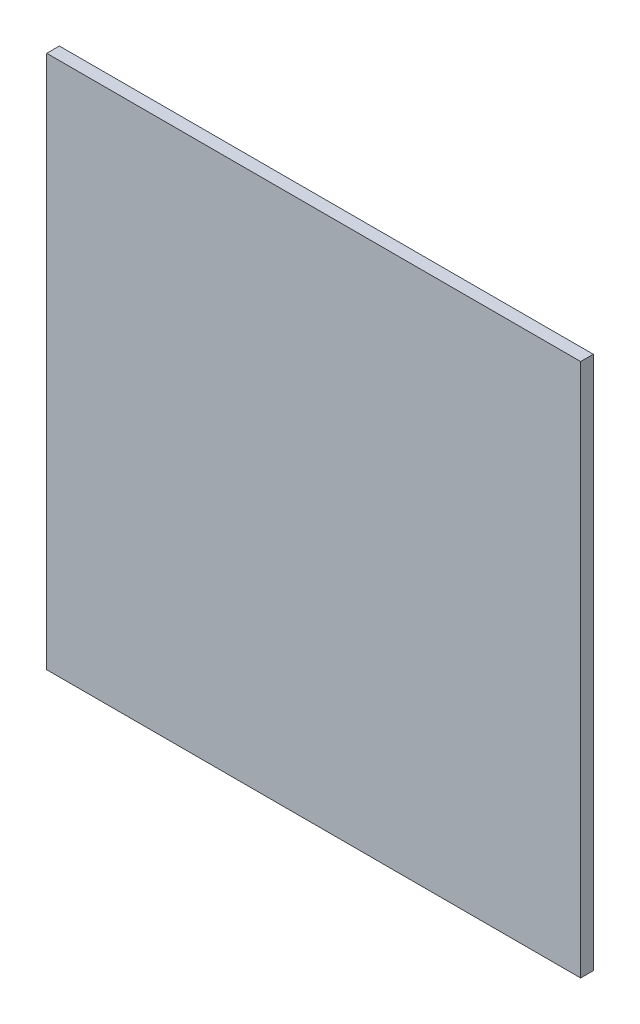
ISO-10303-21;
HEADER;
FILE_DESCRIPTION(('STEP AP214'),'2;1');
FILE_NAME('part.step','',(''),(''),'','','');
FILE_SCHEMA(('AUTOMOTIVE_DESIGN { 1 0 10303 214 1 1 1 1 }'));
ENDSEC;
DATA;
#1=APPLICATION_CONTEXT('core data for automotive mechanical design processes');
#2=APPLICATION_PROTOCOL_DEFINITION('international standard','automotive_design',2000,#1);
#3=PRODUCT_CONTEXT('',#1,'mechanical');
#4=PRODUCT('Part','Part','',(#3));
#5=PRODUCT_RELATED_PRODUCT_CATEGORY('part','',(#4));
#6=PRODUCT_DEFINITION_FORMATION('','',#4);
#7=PRODUCT_DEFINITION_CONTEXT('part definition',#1,'design');
#8=PRODUCT_DEFINITION('design','',#6,#7);
#9=PRODUCT_DEFINITION_SHAPE('','',#8);
#10=(LENGTH_UNIT() NAMED_UNIT(*) SI_UNIT(.MILLI.,.METRE.));
#11=(NAMED_UNIT(*) PLANE_ANGLE_UNIT() SI_UNIT($,.RADIAN.));
#12=(NAMED_UNIT(*) SI_UNIT($,.STERADIAN.) SOLID_ANGLE_UNIT());
#13=UNCERTAINTY_MEASURE_WITH_UNIT(LENGTH_MEASURE(1.E-05),#10,'distance_accuracy_value','');
#14=(GEOMETRIC_REPRESENTATION_CONTEXT(3) GLOBAL_UNCERTAINTY_ASSIGNED_CONTEXT((#13)) GLOBAL_UNIT_ASSIGNED_CONTEXT((#10,
#11,#12)) REPRESENTATION_CONTEXT('',''));
#15=CARTESIAN_POINT('',(0.,0.,0.));
#16=DIRECTION('',(0.,0.,1.));
#17=DIRECTION('',(1.,0.,0.));
#18=AXIS2_PLACEMENT_3D('',#15,#16,#17);
#19=CARTESIAN_POINT('',(6.60008,7.575,0.));
#20=DIRECTION('',(0.,0.,-1.));
#21=DIRECTION('',(-1.,0.,0.));
#22=AXIS2_PLACEMENT_3D('',#19,#20,#21);
#23=PLANE('',#22);
#24=DIRECTION('',(1.,0.,0.));
#25=VECTOR('',#24,1.);
#26=CARTESIAN_POINT('',(5.87508,8.3,0.));
#27=LINE('',#26,#25);
#28=CARTESIAN_POINT('',(5.87508,8.3,0.));
#29=VERTEX_POINT('',#28);
#30=CARTESIAN_POINT('',(7.32508,8.3,0.));
#31=VERTEX_POINT('',#30);
#32=EDGE_CURVE('E55',#29,#31,#27,.T.);
#33=ORIENTED_EDGE('',*,*,#32,.T.);
#34=DIRECTION('',(0.,1.,0.));
#35=VECTOR('',#34,1.);
#36=CARTESIAN_POINT('',(7.32508,8.3,0.));
#37=LINE('',#36,#35);
#38=CARTESIAN_POINT('',(7.32508,6.85,0.));
#39=VERTEX_POINT('',#38);
#40=EDGE_CURVE('E57',#31,#39,#37,.F.);
#41=ORIENTED_EDGE('',*,*,#40,.T.);
#42=DIRECTION('',(1.,0.,0.));
#43=VECTOR('',#42,1.);
#44=CARTESIAN_POINT('',(7.32508,6.85,0.));
#45=LINE('',#44,#43);
#46=CARTESIAN_POINT('',(5.87508,6.85,0.));
#47=VERTEX_POINT('',#46);
#48=EDGE_CURVE('E20',#39,#47,#45,.F.);
#49=ORIENTED_EDGE('',*,*,#48,.T.);
#50=DIRECTION('',(0.,1.,0.));
#51=VECTOR('',#50,1.);
#52=CARTESIAN_POINT('',(5.87508,6.85,0.));
#53=LINE('',#52,#51);
#54=EDGE_CURVE('E80',#47,#29,#53,.T.);
#55=ORIENTED_EDGE('',*,*,#54,.T.);
#56=EDGE_LOOP('',(#33,#41,#49,#55));
#57=FACE_BOUND('',#56,.T.);
#58=ADVANCED_FACE('F17',(#57),#23,.T.);
#59=CARTESIAN_POINT('',(7.32508,6.85,0.));
#60=DIRECTION('',(0.,1.,0.));
#61=DIRECTION('',(0.,0.,1.));
#62=AXIS2_PLACEMENT_3D('',#59,#60,#61);
#63=PLANE('',#62);
#64=DIRECTION('',(0.,0.,-1.));
#65=VECTOR('',#64,1.);
#66=CARTESIAN_POINT('',(5.87508,6.85,0.));
#67=LINE('',#66,#65);
#68=CARTESIAN_POINT('',(5.87508,6.85,0.03429));
#69=VERTEX_POINT('',#68);
#70=EDGE_CURVE('E68',#69,#47,#67,.T.);
#71=ORIENTED_EDGE('',*,*,#70,.T.);
#72=ORIENTED_EDGE('',*,*,#48,.F.);
#73=DIRECTION('',(0.,0.,1.));
#74=VECTOR('',#73,1.);
#75=CARTESIAN_POINT('',(7.32508,6.85,0.));
#76=LINE('',#75,#74);
#77=CARTESIAN_POINT('',(7.32508,6.85,0.03429));
#78=VERTEX_POINT('',#77);
#79=EDGE_CURVE('E63',#39,#78,#76,.T.);
#80=ORIENTED_EDGE('',*,*,#79,.T.);
#81=DIRECTION('',(1.,0.,0.));
#82=VECTOR('',#81,1.);
#83=CARTESIAN_POINT('',(6.60008,6.85,0.03429));
#84=LINE('',#83,#82);
#85=EDGE_CURVE('E83',#69,#78,#84,.T.);
#86=ORIENTED_EDGE('',*,*,#85,.F.);
#87=EDGE_LOOP('',(#71,#72,#80,#86));
#88=FACE_BOUND('',#87,.T.);
#89=ADVANCED_FACE('F65',(#88),#63,.F.);
#90=CARTESIAN_POINT('',(7.32508,8.3,0.));
#91=DIRECTION('',(-1.,0.,0.));
#92=DIRECTION('',(0.,0.,1.));
#93=AXIS2_PLACEMENT_3D('',#90,#91,#92);
#94=PLANE('',#93);
#95=ORIENTED_EDGE('',*,*,#79,.F.);
#96=ORIENTED_EDGE('',*,*,#40,.F.);
#97=DIRECTION('',(0.,0.,-1.));
#98=VECTOR('',#97,1.);
#99=CARTESIAN_POINT('',(7.32508,8.3,0.));
#100=LINE('',#99,#98);
#101=CARTESIAN_POINT('',(7.32508,8.3,0.03429));
#102=VERTEX_POINT('',#101);
#103=EDGE_CURVE('E75',#31,#102,#100,.F.);
#104=ORIENTED_EDGE('',*,*,#103,.T.);
#105=DIRECTION('',(0.,1.,0.));
#106=VECTOR('',#105,1.);
#107=CARTESIAN_POINT('',(7.32508,7.575,0.03429));
#108=LINE('',#107,#106);
#109=EDGE_CURVE('E72',#78,#102,#108,.T.);
#110=ORIENTED_EDGE('',*,*,#109,.F.);
#111=EDGE_LOOP('',(#95,#96,#104,#110));
#112=FACE_BOUND('',#111,.T.);
#113=ADVANCED_FACE('F70',(#112),#94,.F.);
#114=CARTESIAN_POINT('',(5.87508,8.3,0.));
#115=DIRECTION('',(0.,-1.,0.));
#116=DIRECTION('',(0.,0.,-1.));
#117=AXIS2_PLACEMENT_3D('',#114,#115,#116);
#118=PLANE('',#117);
#119=ORIENTED_EDGE('',*,*,#103,.F.);
#120=ORIENTED_EDGE('',*,*,#32,.F.);
#121=DIRECTION('',(0.,0.,-1.));
#122=VECTOR('',#121,1.);
#123=CARTESIAN_POINT('',(5.87508,8.3,0.));
#124=LINE('',#123,#122);
#125=CARTESIAN_POINT('',(5.87508,8.3,0.03429));
#126=VERTEX_POINT('',#125);
#127=EDGE_CURVE('E35',#29,#126,#124,.F.);
#128=ORIENTED_EDGE('',*,*,#127,.T.);
#129=DIRECTION('',(1.,0.,0.));
#130=VECTOR('',#129,1.);
#131=CARTESIAN_POINT('',(6.60008,8.3,0.03429));
#132=LINE('',#131,#130);
#133=EDGE_CURVE('E26',#102,#126,#132,.F.);
#134=ORIENTED_EDGE('',*,*,#133,.F.);
#135=EDGE_LOOP('',(#119,#120,#128,#134));
#136=FACE_BOUND('',#135,.T.);
#137=ADVANCED_FACE('F89',(#136),#118,.F.);
#138=CARTESIAN_POINT('',(5.87508,6.85,0.));
#139=DIRECTION('',(1.,0.,0.));
#140=DIRECTION('',(0.,0.,-1.));
#141=AXIS2_PLACEMENT_3D('',#138,#139,#140);
#142=PLANE('',#141);
#143=ORIENTED_EDGE('',*,*,#127,.F.);
#144=ORIENTED_EDGE('',*,*,#54,.F.);
#145=ORIENTED_EDGE('',*,*,#70,.F.);
#146=DIRECTION('',(0.,1.,0.));
#147=VECTOR('',#146,1.);
#148=CARTESIAN_POINT('',(5.87508,7.575,0.03429));
#149=LINE('',#148,#147);
#150=EDGE_CURVE('E11',#126,#69,#149,.F.);
#151=ORIENTED_EDGE('',*,*,#150,.F.);
#152=EDGE_LOOP('',(#143,#144,#145,#151));
#153=FACE_BOUND('',#152,.T.);
#154=ADVANCED_FACE('F91',(#153),#142,.F.);
#155=CARTESIAN_POINT('',(6.60008,7.575,0.03429));
#156=DIRECTION('',(0.,0.,1.));
#157=DIRECTION('',(1.,0.,0.));
#158=AXIS2_PLACEMENT_3D('',#155,#156,#157);
#159=PLANE('',#158);
#160=ORIENTED_EDGE('',*,*,#133,.T.);
#161=ORIENTED_EDGE('',*,*,#150,.T.);
#162=ORIENTED_EDGE('',*,*,#85,.T.);
#163=ORIENTED_EDGE('',*,*,#109,.T.);
#164=EDGE_LOOP('',(#160,#161,#162,#163));
#165=FACE_BOUND('',#164,.T.);
#166=ADVANCED_FACE('F88',(#165),#159,.T.);
#167=CLOSED_SHELL('',(#58,#89,#113,#137,#154,#166));
#168=MANIFOLD_SOLID_BREP('B1',#167);
#169=ADVANCED_BREP_SHAPE_REPRESENTATION('',(#18,#168),#14);
#170=SHAPE_DEFINITION_REPRESENTATION(#9,#169);
ENDSEC;
END-ISO-10303-21;
